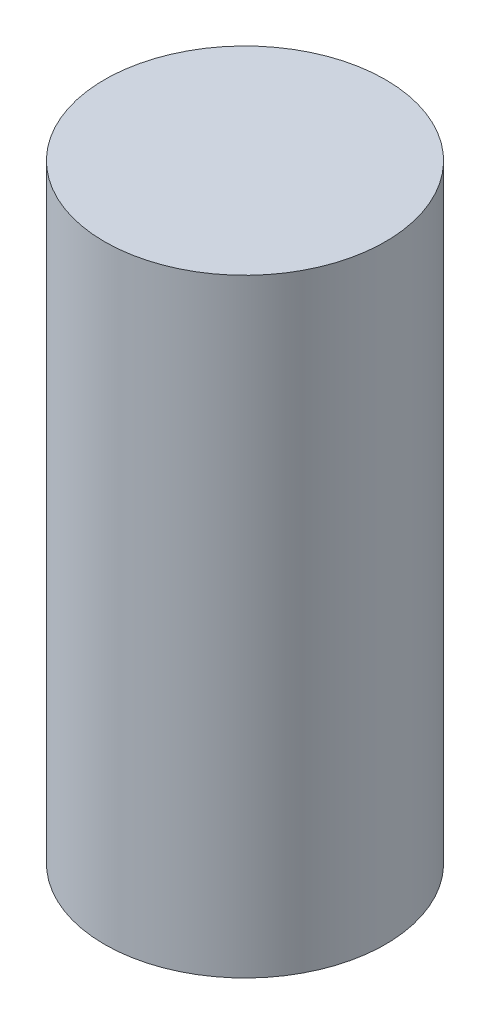
ISO-10303-21;
HEADER;
FILE_DESCRIPTION(('STEP AP214'),'2;1');
FILE_NAME('part.step','',(''),(''),'','','');
FILE_SCHEMA(('AUTOMOTIVE_DESIGN { 1 0 10303 214 1 1 1 1 }'));
ENDSEC;
DATA;
#1=APPLICATION_CONTEXT('core data for automotive mechanical design processes');
#2=APPLICATION_PROTOCOL_DEFINITION('international standard','automotive_design',2000,#1);
#3=PRODUCT_CONTEXT('',#1,'mechanical');
#4=PRODUCT('Part','Part','',(#3));
#5=PRODUCT_RELATED_PRODUCT_CATEGORY('part','',(#4));
#6=PRODUCT_DEFINITION_FORMATION('','',#4);
#7=PRODUCT_DEFINITION_CONTEXT('part definition',#1,'design');
#8=PRODUCT_DEFINITION('design','',#6,#7);
#9=PRODUCT_DEFINITION_SHAPE('','',#8);
#10=(LENGTH_UNIT() NAMED_UNIT(*) SI_UNIT(.MILLI.,.METRE.));
#11=(NAMED_UNIT(*) PLANE_ANGLE_UNIT() SI_UNIT($,.RADIAN.));
#12=(NAMED_UNIT(*) SI_UNIT($,.STERADIAN.) SOLID_ANGLE_UNIT());
#13=UNCERTAINTY_MEASURE_WITH_UNIT(LENGTH_MEASURE(1.E-05),#10,'distance_accuracy_value','');
#14=(GEOMETRIC_REPRESENTATION_CONTEXT(3) GLOBAL_UNCERTAINTY_ASSIGNED_CONTEXT((#13)) GLOBAL_UNIT_ASSIGNED_CONTEXT((#10,
#11,#12)) REPRESENTATION_CONTEXT('',''));
#15=CARTESIAN_POINT('',(0.,0.,0.));
#16=DIRECTION('',(0.,0.,1.));
#17=DIRECTION('',(1.,0.,0.));
#18=AXIS2_PLACEMENT_3D('',#15,#16,#17);
#19=CARTESIAN_POINT('',(0.,13.,0.));
#20=DIRECTION('',(0.,-1.,0.));
#21=DIRECTION('',(0.,0.,-1.));
#22=AXIS2_PLACEMENT_3D('',#19,#20,#21);
#23=CYLINDRICAL_SURFACE('',#22,3.);
#24=CARTESIAN_POINT('',(0.,13.,0.));
#25=DIRECTION('',(0.,1.,0.));
#26=DIRECTION('',(0.,0.,1.));
#27=AXIS2_PLACEMENT_3D('',#24,#25,#26);
#28=CIRCLE('',#27,3.);
#29=CARTESIAN_POINT('',(0.,13.,3.));
#30=VERTEX_POINT('',#29);
#31=EDGE_CURVE('E10',#30,#30,#28,.T.);
#32=ORIENTED_EDGE('',*,*,#31,.F.);
#33=EDGE_LOOP('',(#32));
#34=FACE_BOUND('',#33,.T.);
#35=CARTESIAN_POINT('',(0.,0.,0.));
#36=DIRECTION('',(0.,1.,0.));
#37=DIRECTION('',(0.,0.,1.));
#38=AXIS2_PLACEMENT_3D('',#35,#36,#37);
#39=CIRCLE('',#38,3.);
#40=CARTESIAN_POINT('',(0.,0.,3.));
#41=VERTEX_POINT('',#40);
#42=EDGE_CURVE('E46',#41,#41,#39,.T.);
#43=ORIENTED_EDGE('',*,*,#42,.T.);
#44=EDGE_LOOP('',(#43));
#45=FACE_BOUND('',#44,.T.);
#46=ADVANCED_FACE('F43',(#34,#45),#23,.T.);
#47=CARTESIAN_POINT('',(0.,13.,0.));
#48=DIRECTION('',(0.,1.,0.));
#49=DIRECTION('',(0.,0.,1.));
#50=AXIS2_PLACEMENT_3D('',#47,#48,#49);
#51=PLANE('',#50);
#52=ORIENTED_EDGE('',*,*,#31,.T.);
#53=EDGE_LOOP('',(#52));
#54=FACE_BOUND('',#53,.T.);
#55=ADVANCED_FACE('F60',(#54),#51,.T.);
#56=CARTESIAN_POINT('',(0.,0.,0.));
#57=DIRECTION('',(0.,1.,0.));
#58=DIRECTION('',(0.,0.,1.));
#59=AXIS2_PLACEMENT_3D('',#56,#57,#58);
#60=PLANE('',#59);
#61=ORIENTED_EDGE('',*,*,#42,.F.);
#62=EDGE_LOOP('',(#61));
#63=FACE_BOUND('',#62,.T.);
#64=ADVANCED_FACE('F58',(#63),#60,.F.);
#65=CLOSED_SHELL('',(#46,#55,#64));
#66=MANIFOLD_SOLID_BREP('B2',#65);
#67=ADVANCED_BREP_SHAPE_REPRESENTATION('',(#18,#66),#14);
#68=SHAPE_DEFINITION_REPRESENTATION(#9,#67);
ENDSEC;
END-ISO-10303-21;
